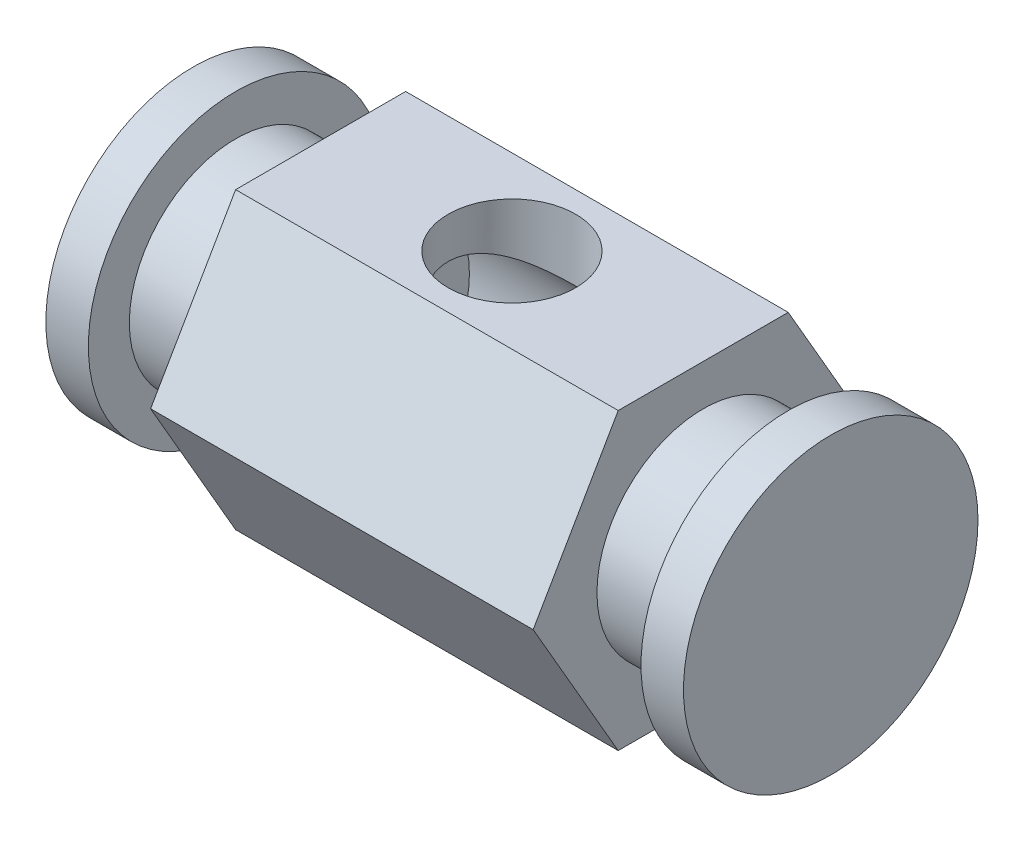
ISO-10303-21;
HEADER;
FILE_DESCRIPTION(('STEP AP214'),'2;1');
FILE_NAME('part.step','',(''),(''),'','','');
FILE_SCHEMA(('AUTOMOTIVE_DESIGN { 1 0 10303 214 1 1 1 1 }'));
ENDSEC;
DATA;
#1=APPLICATION_CONTEXT('core data for automotive mechanical design processes');
#2=APPLICATION_PROTOCOL_DEFINITION('international standard','automotive_design',2000,#1);
#3=PRODUCT_CONTEXT('',#1,'mechanical');
#4=PRODUCT('Part','Part','',(#3));
#5=PRODUCT_RELATED_PRODUCT_CATEGORY('part','',(#4));
#6=PRODUCT_DEFINITION_FORMATION('','',#4);
#7=PRODUCT_DEFINITION_CONTEXT('part definition',#1,'design');
#8=PRODUCT_DEFINITION('design','',#6,#7);
#9=PRODUCT_DEFINITION_SHAPE('','',#8);
#10=(LENGTH_UNIT() NAMED_UNIT(*) SI_UNIT(.MILLI.,.METRE.));
#11=(NAMED_UNIT(*) PLANE_ANGLE_UNIT() SI_UNIT($,.RADIAN.));
#12=(NAMED_UNIT(*) SI_UNIT($,.STERADIAN.) SOLID_ANGLE_UNIT());
#13=UNCERTAINTY_MEASURE_WITH_UNIT(LENGTH_MEASURE(1.E-05),#10,'distance_accuracy_value','');
#14=(GEOMETRIC_REPRESENTATION_CONTEXT(3) GLOBAL_UNCERTAINTY_ASSIGNED_CONTEXT((#13)) GLOBAL_UNIT_ASSIGNED_CONTEXT((#10,
#11,#12)) REPRESENTATION_CONTEXT('',''));
#15=CARTESIAN_POINT('',(0.,0.,0.));
#16=DIRECTION('',(0.,0.,1.));
#17=DIRECTION('',(1.,0.,0.));
#18=AXIS2_PLACEMENT_3D('',#15,#16,#17);
#19=CARTESIAN_POINT('',(22.5,0.,0.));
#20=DIRECTION('',(-1.,0.,0.));
#21=DIRECTION('',(0.,0.,1.));
#22=AXIS2_PLACEMENT_3D('',#19,#20,#21);
#23=CYLINDRICAL_SURFACE('',#22,12.5);
#24=CARTESIAN_POINT('',(17.5,0.,0.));
#25=DIRECTION('',(1.,0.,0.));
#26=DIRECTION('',(0.,0.,-1.));
#27=AXIS2_PLACEMENT_3D('',#24,#25,#26);
#28=CIRCLE('',#27,12.5);
#29=CARTESIAN_POINT('',(17.5,0.,-12.5));
#30=VERTEX_POINT('',#29);
#31=EDGE_CURVE('E208',#30,#30,#28,.T.);
#32=ORIENTED_EDGE('',*,*,#31,.T.);
#33=EDGE_LOOP('',(#32));
#34=FACE_BOUND('',#33,.T.);
#35=CARTESIAN_POINT('',(0.,-10.,7.5));
#36=CARTESIAN_POINT('',(0.188692773104688,-9.99999823078383,7.50000120679242));
#37=CARTESIAN_POINT('',(0.377372231482413,-10.0053601477454,7.49286874148265));
#38=CARTESIAN_POINT('',(0.753055741609481,-10.0265610634639,7.46447502665632));
#39=CARTESIAN_POINT('',(0.940059904060489,-10.0423993646996,7.44321471777582));
#40=CARTESIAN_POINT('',(1.31103429157001,-10.0838875511475,7.38690918482064));
#41=CARTESIAN_POINT('',(1.49500158372569,-10.1095464015261,7.35185136418562));
#42=CARTESIAN_POINT('',(1.85843271331336,-10.1696429705428,7.26849331083707));
#43=CARTESIAN_POINT('',(2.0378963147779,-10.2040811481166,7.22019238583577));
#44=CARTESIAN_POINT('',(2.38994614713429,-10.2802003218269,7.11138858218429));
#45=CARTESIAN_POINT('',(2.56257402518394,-10.3218247593381,7.05098043543781));
#46=CARTESIAN_POINT('',(2.90163367268208,-10.4111819148763,6.9183586416477));
#47=CARTESIAN_POINT('',(3.06806298347129,-10.4589170240795,6.84614037008011));
#48=CARTESIAN_POINT('',(3.5570088898786,-10.6092473794473,6.61272201077553));
#49=CARTESIAN_POINT('',(3.86941771930208,-10.7190214536722,6.43468492430838));
#50=CARTESIAN_POINT('',(4.49983310186811,-10.961457844936,6.01351023928956));
#51=CARTESIAN_POINT('',(4.81385372032728,-11.0952775973879,5.76507448644969));
#52=CARTESIAN_POINT('',(5.25250928504391,-11.2947767726125,5.35733763463461));
#53=CARTESIAN_POINT('',(5.39341905252056,-11.3611173580496,5.21546669500758));
#54=CARTESIAN_POINT('',(5.66389561288898,-11.4919832543935,4.92039993723567));
#55=CARTESIAN_POINT('',(5.79346040775826,-11.5565082441938,4.76720213298469));
#56=CARTESIAN_POINT('',(6.05387736830032,-11.6891210188159,4.43285564137838));
#57=CARTESIAN_POINT('',(6.18334510449195,-11.7568362139061,4.25047753744622));
#58=CARTESIAN_POINT('',(6.42623807951091,-11.8863782053003,3.87346312854206));
#59=CARTESIAN_POINT('',(6.53967045659397,-11.9482076176741,3.67883233406749));
#60=CARTESIAN_POINT('',(6.74929824514343,-12.0642201883362,3.2784164671804));
#61=CARTESIAN_POINT('',(6.84550107726848,-12.1184066362557,3.07263624673865));
#62=CARTESIAN_POINT('',(7.01944969456585,-12.2175104392727,2.65127326533902));
#63=CARTESIAN_POINT('',(7.0971985128734,-12.2624293174459,2.43569212222876));
#64=CARTESIAN_POINT('',(7.2265508104083,-12.3377691728578,2.01747359212342));
#65=CARTESIAN_POINT('',(7.27994111935902,-12.3691645244113,1.81556383007454));
#66=CARTESIAN_POINT('',(7.36985691367482,-12.4222973608661,1.40676725051505));
#67=CARTESIAN_POINT('',(7.40638337680498,-12.4440354056949,1.19988072228908));
#68=CARTESIAN_POINT('',(7.46196289662482,-12.477194920202,0.783116791483749));
#69=CARTESIAN_POINT('',(7.48102963470044,-12.4886244674807,0.573241861806046));
#70=CARTESIAN_POINT('',(7.50141157120872,-12.5008442041257,0.152330680482684));
#71=CARTESIAN_POINT('',(7.50272857571368,-12.5016354759586,-0.0587054508221876));
#72=CARTESIAN_POINT('',(7.48853906892484,-12.4931260267531,-0.453714777156578));
#73=CARTESIAN_POINT('',(7.47510185603572,-12.4850666053635,-0.637793616435806));
#74=CARTESIAN_POINT('',(7.43478376412771,-12.4609689355091,-1.00394655598314));
#75=CARTESIAN_POINT('',(7.40790295021372,-12.4449307256842,-1.18602066595543));
#76=CARTESIAN_POINT('',(7.3410358323648,-12.4052442277447,-1.54689074708866));
#77=CARTESIAN_POINT('',(7.30104970200605,-12.3815960404222,-1.72568676163393));
#78=CARTESIAN_POINT('',(7.20844210361948,-12.3272151907499,-2.07886939421951));
#79=CARTESIAN_POINT('',(7.155820114962,-12.2964822364917,-2.25325583024659));
#80=CARTESIAN_POINT('',(7.03817333792658,-12.2283918721564,-2.59757407732022));
#81=CARTESIAN_POINT('',(6.97308161624169,-12.1909987925766,-2.76747594566571));
#82=CARTESIAN_POINT('',(6.83130799278641,-12.1104656177526,-3.10098446114959));
#83=CARTESIAN_POINT('',(6.7546222287775,-12.0673236079794,-3.26458898762978));
#84=CARTESIAN_POINT('',(6.50814521196327,-11.9305144973489,-3.74477506801769));
#85=CARTESIAN_POINT('',(6.3218550439595,-11.8294173233651,-4.05095816681986));
#86=CARTESIAN_POINT('',(5.88579358864849,-11.6018914143767,-4.66541618539828));
#87=CARTESIAN_POINT('',(5.63109761876534,-11.4738793152295,-4.9695726070298));
#88=CARTESIAN_POINT('',(5.07794018109779,-11.2127575101819,-5.5335940307367));
#89=CARTESIAN_POINT('',(4.77941947736904,-11.0796410878055,-5.7933980391173));
#90=CARTESIAN_POINT('',(4.28409925606161,-10.8778361830914,-6.15997312633097));
#91=CARTESIAN_POINT('',(4.10058958896489,-10.8066538673819,-6.28366126969308));
#92=CARTESIAN_POINT('',(3.72202575670407,-10.6687579062864,-6.51503745890077));
#93=CARTESIAN_POINT('',(3.52696970058253,-10.602044996692,-6.62272287377845));
#94=CARTESIAN_POINT('',(3.12652125290092,-10.4756432504103,-6.82090231570387));
#95=CARTESIAN_POINT('',(2.92114494481455,-10.4159439402154,-6.91142210385062));
#96=CARTESIAN_POINT('',(2.50090829012674,-10.305992775228,-7.07433274728352));
#97=CARTESIAN_POINT('',(2.28605170832038,-10.2557372111069,-7.14673072420734));
#98=CARTESIAN_POINT('',(1.90263340778911,-10.178114111283,-7.25667461828035));
#99=CARTESIAN_POINT('',(1.73578617557886,-10.1481606268142,-7.29841140631324));
#100=CARTESIAN_POINT('',(1.39847645342368,-10.0959398034874,-7.37048077339704));
#101=CARTESIAN_POINT('',(1.22801477044022,-10.0736707677861,-7.40081587024739));
#102=CARTESIAN_POINT('',(0.88467910293567,-10.037606550335,-7.44965633189382));
#103=CARTESIAN_POINT('',(0.711807598531673,-10.0238032320233,-7.4681730562511));
#104=CARTESIAN_POINT('',(0.364704061930949,-10.0051477481708,-7.49314782944574));
#105=CARTESIAN_POINT('',(0.190472000959253,-10.0002957724635,-7.4996056225464));
#106=CARTESIAN_POINT('',(-0.158273249010935,-9.99973014508067,-7.50035982068346));
#107=CARTESIAN_POINT('',(-0.332786495033985,-10.0040290732705,-7.49463948428721));
#108=CARTESIAN_POINT('',(-0.680531944099266,-10.0216248303757,-7.47109423447713));
#109=CARTESIAN_POINT('',(-0.853764140464238,-10.034921706158,-7.45326925801477));
#110=CARTESIAN_POINT('',(-1.1977974129686,-10.0700255654224,-7.40577159941338));
#111=CARTESIAN_POINT('',(-1.36859727685108,-10.0918366483772,-7.37609320986082));
#112=CARTESIAN_POINT('',(-1.70667432339135,-10.1432145107887,-7.30527949826134));
#113=CARTESIAN_POINT('',(-1.8739500378864,-10.172784456172,-7.26413949899432));
#114=CARTESIAN_POINT('',(-2.20374031188016,-10.2386720947097,-7.17097191379845));
#115=CARTESIAN_POINT('',(-2.36626272005138,-10.274977841261,-7.1189635835979));
#116=CARTESIAN_POINT('',(-2.68619223147815,-10.3533352508685,-7.00451682931186));
#117=CARTESIAN_POINT('',(-2.8435976378413,-10.3953887964191,-6.94207498659024));
#118=CARTESIAN_POINT('',(-3.30723467778529,-10.5285418463914,-6.73987072741965));
#119=CARTESIAN_POINT('',(-3.60504547886708,-10.6266672038671,-6.58518422132203));
#120=CARTESIAN_POINT('',(-4.22628250436646,-10.8518645415799,-6.20832715462771));
#121=CARTESIAN_POINT('',(-4.54464774892117,-10.9809658731543,-5.9790180424004));
#122=CARTESIAN_POINT('',(-4.99214330661705,-11.1760249043361,-5.60060254239724));
#123=CARTESIAN_POINT('',(-5.13640074272676,-11.2413306806479,-5.46860539765543));
#124=CARTESIAN_POINT('',(-5.41443062347967,-11.3710562458251,-5.19347495646691));
#125=CARTESIAN_POINT('',(-5.54820120771097,-11.4354758758204,-5.05033969300513));
#126=CARTESIAN_POINT('',(-5.82131514437674,-11.5702992750371,-4.73407411681794));
#127=CARTESIAN_POINT('',(-5.95910849863414,-11.6403872249459,-4.55946685321339));
#128=CARTESIAN_POINT('',(-6.21936179384066,-11.7757426572854,-4.19752243251675));
#129=CARTESIAN_POINT('',(-6.34182793854949,-11.8410120856195,-4.01019047347924));
#130=CARTESIAN_POINT('',(-6.57031577035696,-11.9649421100263,-3.62371710093581));
#131=CARTESIAN_POINT('',(-6.67634116026973,-12.0236041933995,-3.4245783605802));
#132=CARTESIAN_POINT('',(-6.87072708731596,-12.1326177402039,-3.0156810985293));
#133=CARTESIAN_POINT('',(-6.95909003276554,-12.1829703364898,-2.80592402956304));
#134=CARTESIAN_POINT('',(-7.1111773112232,-12.2705038668088,-2.39290771317297));
#135=CARTESIAN_POINT('',(-7.17622475903736,-12.308375712443,-2.19028248858964));
#136=CARTESIAN_POINT('',(-7.28913769564021,-12.3745477559289,-1.778758838461));
#137=CARTESIAN_POINT('',(-7.3370038235628,-12.4028483098242,-1.56986064657932));
#138=CARTESIAN_POINT('',(-7.41475182068993,-12.4489985951498,-1.14780479520938));
#139=CARTESIAN_POINT('',(-7.44465062820149,-12.4668581691577,-0.934651343809274));
#140=CARTESIAN_POINT('',(-7.48601236995236,-12.4916012697912,-0.505939659922356));
#141=CARTESIAN_POINT('',(-7.49747770748443,-12.4984862272487,-0.290381744611884));
#142=CARTESIAN_POINT('',(-7.50149083731495,-12.5008948532131,0.112151821569249));
#143=CARTESIAN_POINT('',(-7.49635999809251,-12.4978126770678,0.299101086082838));
#144=CARTESIAN_POINT('',(-7.47218709467063,-12.4833282510086,0.671773742150895));
#145=CARTESIAN_POINT('',(-7.45314537944419,-12.4719262098097,0.857497164339332));
#146=CARTESIAN_POINT('',(-7.40140400507448,-12.4410751634198,1.22633646290172));
#147=CARTESIAN_POINT('',(-7.36870500971334,-12.4216265493153,1.40945246555634));
#148=CARTESIAN_POINT('',(-7.29006169982175,-12.3751361717483,1.77183006760248));
#149=CARTESIAN_POINT('',(-7.24411698832095,-12.3480941807152,1.9510915513021));
#150=CARTESIAN_POINT('',(-7.14036425079735,-12.2875162258367,2.30175557439519));
#151=CARTESIAN_POINT('',(-7.08276181686451,-12.2540933057182,2.47323858855957));
#152=CARTESIAN_POINT('',(-6.95583265831419,-12.1811708599912,2.81049732306679));
#153=CARTESIAN_POINT('',(-6.88650213772686,-12.1416693673375,2.97627117457875));
#154=CARTESIAN_POINT('',(-6.66186004706047,-12.0151967745144,3.46373719515787));
#155=CARTESIAN_POINT('',(-6.48982400648675,-11.9202132953099,3.7758204727761));
#156=CARTESIAN_POINT('',(-6.08534983857752,-11.7046609545403,4.401374151397));
#157=CARTESIAN_POINT('',(-5.84838193641815,-11.5824339466914,4.7113171053629));
#158=CARTESIAN_POINT('',(-5.33125937723798,-11.3301036620341,5.28946389728756));
#159=CARTESIAN_POINT('',(-5.05105687747664,-11.1999917579732,5.55762082660486));
#160=CARTESIAN_POINT('',(-4.41348879871702,-10.9263829364944,6.07959239913489));
#161=CARTESIAN_POINT('',(-4.05084402361769,-10.7832810292532,6.32727585963683));
#162=CARTESIAN_POINT('',(-3.47462714205365,-10.5849217173034,6.65022773867512));
#163=CARTESIAN_POINT('',(-3.27711979225767,-10.5215019916803,6.74980398536693));
#164=CARTESIAN_POINT('',(-2.87201477324607,-10.4024521257067,6.93186784584636));
#165=CARTESIAN_POINT('',(-2.66441725456022,-10.3468218691974,7.01435571446969));
#166=CARTESIAN_POINT('',(-2.25848300148507,-10.2501351559249,7.15481558011699));
#167=CARTESIAN_POINT('',(-2.06086076902219,-10.2082415060397,7.21427616671245));
#168=CARTESIAN_POINT('',(-1.65965877490963,-10.1348719640507,7.31699130623615));
#169=CARTESIAN_POINT('',(-1.45608299276073,-10.103389278735,7.36025642923621));
#170=CARTESIAN_POINT('',(-1.04488685636496,-10.0523754060515,7.42977906555983));
#171=CARTESIAN_POINT('',(-0.837273411131533,-10.0328253876625,7.45606338026241));
#172=CARTESIAN_POINT('',(-0.419767626510736,-10.0066394811847,7.49117207766574));
#173=CARTESIAN_POINT('',(-0.209875577270451,-10.0000019678298,7.49999865773208));
#174=CARTESIAN_POINT('',(0.,-10.,7.5));
#175=B_SPLINE_CURVE_WITH_KNOTS('',3,(#35,#36,#37,#38,#39,#40,#41,#42,#43,#44,#45,#46,#47,#48,
#49,#50,#51,#52,#53,#54,#55,#56,#57,#58,#59,#60,#61,#62,#63,#64,#65,#66,#67,#68,#69,#70,#71,#72,
#73,#74,#75,#76,#77,#78,#79,#80,#81,#82,#83,#84,#85,#86,#87,#88,#89,#90,#91,#92,#93,#94,#95,#96,
#97,#98,#99,#100,#101,#102,#103,#104,#105,#106,#107,#108,#109,#110,#111,#112,#113,#114,#115,
#116,#117,#118,#119,#120,#121,#122,#123,#124,#125,#126,#127,#128,#129,#130,#131,#132,#133,#134,
#135,#136,#137,#138,#139,#140,#141,#142,#143,#144,#145,#146,#147,#148,#149,#150,#151,#152,#153,
#154,#155,#156,#157,#158,#159,#160,#161,#162,#163,#164,#165,#166,#167,#168,#169,#170,#171,#172,
#173,#174),.UNSPECIFIED.,.T.,.F.,(4,2,2,2,2,2,2,2,2,2,2,2,2,2,2,2,2,2,2,2,2,2,2,2,2,2,2,2,2,2,2,
2,2,2,2,2,2,2,2,2,2,2,2,2,2,2,2,2,2,2,2,2,2,2,2,2,2,2,2,2,2,2,2,2,2,2,2,2,2,4),(0.,
0.565847664941352,1.13165765934977,1.69798541775812,2.26434278678839,2.82643055762257,
3.38873895609719,4.51260964228029,5.77389395070291,6.40541950298795,7.03705605377578,
7.73719785519436,8.43702699531025,9.13655399467041,9.83596593876093,10.4686435438572,
11.101284461724,11.7334292188741,12.3655096534955,12.9190805875071,13.4726488407014,
14.026209762338,14.5797934960143,15.1364364428117,15.6932652302445,16.8061898968696,
18.052047981167,19.2996058111948,19.9962788030126,20.6930662066484,21.3887994932595,
22.0842589348901,22.6074630613155,23.1305515822502,23.6531365617513,24.1757326237138,
24.6990475691323,25.222365240323,25.7459351931216,26.2697191165561,26.7925827878468,
27.3156181173834,28.3611893568746,29.5952538232474,30.2132528522665,30.8313612699863,
31.5301138305572,32.2285826467617,32.9268939234563,33.625109918705,34.2726300267248,
34.920126044922,35.5670106885767,36.2138109867834,36.774254703411,37.3346843610389,
37.895086783382,38.4555060025722,39.006789842679,39.5582524566087,40.6604022169002,
41.8822021246453,43.1053638842687,44.4836387355011,45.1731642163991,45.8626794137954,
46.4935387877718,47.1239857065273,47.7534351229369,48.3828053069281),.UNSPECIFIED.);
#176=CARTESIAN_POINT('',(0.,-10.,7.5));
#177=VERTEX_POINT('',#176);
#178=EDGE_CURVE('E36',#177,#177,#175,.T.);
#179=ORIENTED_EDGE('',*,*,#178,.F.);
#180=EDGE_LOOP('',(#179));
#181=FACE_BOUND('',#180,.T.);
#182=CARTESIAN_POINT('',(0.,10.,7.5));
#183=CARTESIAN_POINT('',(-0.188692773104688,9.99999823078383,7.50000120679242));
#184=CARTESIAN_POINT('',(-0.377372231482413,10.0053601477454,7.49286874148265));
#185=CARTESIAN_POINT('',(-0.753055741609481,10.0265610634639,7.46447502665632));
#186=CARTESIAN_POINT('',(-0.940059904060488,10.0423993646996,7.44321471777582));
#187=CARTESIAN_POINT('',(-1.31103429157001,10.0838875511475,7.38690918482064));
#188=CARTESIAN_POINT('',(-1.49500158372569,10.1095464015261,7.35185136418562));
#189=CARTESIAN_POINT('',(-1.85843271331336,10.1696429705428,7.26849331083707));
#190=CARTESIAN_POINT('',(-2.0378963147779,10.2040811481166,7.22019238583578));
#191=CARTESIAN_POINT('',(-2.38994614713428,10.2802003218269,7.1113885821843));
#192=CARTESIAN_POINT('',(-2.56257402518393,10.3218247593381,7.05098043543782));
#193=CARTESIAN_POINT('',(-2.90163367268208,10.4111819148763,6.9183586416477));
#194=CARTESIAN_POINT('',(-3.06806298347128,10.4589170240795,6.84614037008012));
#195=CARTESIAN_POINT('',(-3.5570088898786,10.6092473794473,6.61272201077553));
#196=CARTESIAN_POINT('',(-3.86941771930208,10.7190214536722,6.43468492430838));
#197=CARTESIAN_POINT('',(-4.4998331018681,10.961457844936,6.01351023928957));
#198=CARTESIAN_POINT('',(-4.81385372032728,11.0952775973879,5.7650744864497));
#199=CARTESIAN_POINT('',(-5.25250928504391,11.2947767726125,5.35733763463462));
#200=CARTESIAN_POINT('',(-5.39341905252056,11.3611173580496,5.21546669500759));
#201=CARTESIAN_POINT('',(-5.66389561288898,11.4919832543935,4.92039993723567));
#202=CARTESIAN_POINT('',(-5.79346040775825,11.5565082441938,4.7672021329847));
#203=CARTESIAN_POINT('',(-6.05387736830032,11.6891210188159,4.43285564137839));
#204=CARTESIAN_POINT('',(-6.18334510449195,11.7568362139061,4.25047753744623));
#205=CARTESIAN_POINT('',(-6.4262380795109,11.8863782053003,3.87346312854207));
#206=CARTESIAN_POINT('',(-6.53967045659396,11.9482076176741,3.6788323340675));
#207=CARTESIAN_POINT('',(-6.74929824514343,12.0642201883362,3.27841646718041));
#208=CARTESIAN_POINT('',(-6.84550107726848,12.1184066362557,3.07263624673866));
#209=CARTESIAN_POINT('',(-7.01944969456585,12.2175104392727,2.65127326533903));
#210=CARTESIAN_POINT('',(-7.0971985128734,12.2624293174459,2.43569212222877));
#211=CARTESIAN_POINT('',(-7.2265508104083,12.3377691728578,2.01747359212343));
#212=CARTESIAN_POINT('',(-7.27994111935902,12.3691645244113,1.81556383007455));
#213=CARTESIAN_POINT('',(-7.36985691367482,12.4222973608661,1.40676725051506));
#214=CARTESIAN_POINT('',(-7.40638337680498,12.4440354056949,1.19988072228909));
#215=CARTESIAN_POINT('',(-7.46196289662482,12.477194920202,0.783116791483759));
#216=CARTESIAN_POINT('',(-7.48102963470043,12.4886244674807,0.573241861806056));
#217=CARTESIAN_POINT('',(-7.50141157120872,12.5008442041257,0.152330680482695));
#218=CARTESIAN_POINT('',(-7.50272857571368,12.5016354759586,-0.0587054508221778));
#219=CARTESIAN_POINT('',(-7.48853906892484,12.4931260267531,-0.453714777156568));
#220=CARTESIAN_POINT('',(-7.47510185603573,12.4850666053635,-0.637793616435796));
#221=CARTESIAN_POINT('',(-7.43478376412771,12.4609689355091,-1.00394655598314));
#222=CARTESIAN_POINT('',(-7.40790295021372,12.4449307256842,-1.18602066595542));
#223=CARTESIAN_POINT('',(-7.3410358323648,12.4052442277447,-1.54689074708866));
#224=CARTESIAN_POINT('',(-7.30104970200605,12.3815960404222,-1.72568676163393));
#225=CARTESIAN_POINT('',(-7.20844210361948,12.3272151907499,-2.0788693942195));
#226=CARTESIAN_POINT('',(-7.155820114962,12.2964822364917,-2.25325583024658));
#227=CARTESIAN_POINT('',(-7.03817333792658,12.2283918721564,-2.59757407732021));
#228=CARTESIAN_POINT('',(-6.97308161624169,12.1909987925766,-2.76747594566571));
#229=CARTESIAN_POINT('',(-6.83130799278642,12.1104656177526,-3.10098446114958));
#230=CARTESIAN_POINT('',(-6.7546222287775,12.0673236079794,-3.26458898762977));
#231=CARTESIAN_POINT('',(-6.50814521196328,11.9305144973489,-3.74477506801769));
#232=CARTESIAN_POINT('',(-6.3218550439595,11.8294173233651,-4.05095816681985));
#233=CARTESIAN_POINT('',(-5.8857935886485,11.6018914143767,-4.66541618539827));
#234=CARTESIAN_POINT('',(-5.63109761876534,11.4738793152295,-4.96957260702979));
#235=CARTESIAN_POINT('',(-5.0779401810978,11.2127575101819,-5.5335940307367));
#236=CARTESIAN_POINT('',(-4.77941947736905,11.0796410878055,-5.79339803911729));
#237=CARTESIAN_POINT('',(-4.28409925606161,10.8778361830914,-6.15997312633096));
#238=CARTESIAN_POINT('',(-4.1005895889649,10.8066538673819,-6.28366126969308));
#239=CARTESIAN_POINT('',(-3.72202575670408,10.6687579062864,-6.51503745890076));
#240=CARTESIAN_POINT('',(-3.52696970058254,10.602044996692,-6.62272287377845));
#241=CARTESIAN_POINT('',(-3.12652125290092,10.4756432504103,-6.82090231570386));
#242=CARTESIAN_POINT('',(-2.92114494481456,10.4159439402154,-6.91142210385062));
#243=CARTESIAN_POINT('',(-2.50090829012675,10.305992775228,-7.07433274728351));
#244=CARTESIAN_POINT('',(-2.28605170832039,10.2557372111069,-7.14673072420734));
#245=CARTESIAN_POINT('',(-1.90263340778912,10.178114111283,-7.25667461828035));
#246=CARTESIAN_POINT('',(-1.73578617557887,10.1481606268142,-7.29841140631324));
#247=CARTESIAN_POINT('',(-1.3984764534237,10.0959398034874,-7.37048077339703));
#248=CARTESIAN_POINT('',(-1.22801477044023,10.0736707677861,-7.40081587024738));
#249=CARTESIAN_POINT('',(-0.88467910293568,10.0376065503351,-7.44965633189382));
#250=CARTESIAN_POINT('',(-0.711807598531683,10.0238032320233,-7.4681730562511));
#251=CARTESIAN_POINT('',(-0.36470406193096,10.0051477481708,-7.49314782944574));
#252=CARTESIAN_POINT('',(-0.190472000959263,10.0002957724635,-7.4996056225464));
#253=CARTESIAN_POINT('',(0.158273249010925,9.99973014508067,-7.50035982068346));
#254=CARTESIAN_POINT('',(0.332786495033975,10.0040290732705,-7.49463948428721));
#255=CARTESIAN_POINT('',(0.680531944099254,10.0216248303757,-7.47109423447713));
#256=CARTESIAN_POINT('',(0.853764140464226,10.034921706158,-7.45326925801477));
#257=CARTESIAN_POINT('',(1.19779741296858,10.0700255654224,-7.40577159941338));
#258=CARTESIAN_POINT('',(1.36859727685107,10.0918366483772,-7.37609320986082));
#259=CARTESIAN_POINT('',(1.70667432339134,10.1432145107887,-7.30527949826135));
#260=CARTESIAN_POINT('',(1.87395003788639,10.172784456172,-7.26413949899432));
#261=CARTESIAN_POINT('',(2.20374031188015,10.2386720947097,-7.17097191379845));
#262=CARTESIAN_POINT('',(2.36626272005137,10.274977841261,-7.1189635835979));
#263=CARTESIAN_POINT('',(2.68619223147814,10.3533352508685,-7.00451682931186));
#264=CARTESIAN_POINT('',(2.84359763784129,10.3953887964191,-6.94207498659025));
#265=CARTESIAN_POINT('',(3.30723467778528,10.5285418463914,-6.73987072741965));
#266=CARTESIAN_POINT('',(3.60504547886707,10.6266672038671,-6.58518422132204));
#267=CARTESIAN_POINT('',(4.22628250436645,10.8518645415799,-6.20832715462772));
#268=CARTESIAN_POINT('',(4.54464774892116,10.9809658731543,-5.9790180424004));
#269=CARTESIAN_POINT('',(4.99214330661704,11.1760249043361,-5.60060254239724));
#270=CARTESIAN_POINT('',(5.13640074272675,11.2413306806479,-5.46860539765543));
#271=CARTESIAN_POINT('',(5.41443062347967,11.3710562458251,-5.19347495646691));
#272=CARTESIAN_POINT('',(5.54820120771097,11.4354758758204,-5.05033969300514));
#273=CARTESIAN_POINT('',(5.82131514437674,11.5702992750371,-4.73407411681794));
#274=CARTESIAN_POINT('',(5.95910849863413,11.6403872249459,-4.5594668532134));
#275=CARTESIAN_POINT('',(6.21936179384066,11.7757426572854,-4.19752243251676));
#276=CARTESIAN_POINT('',(6.34182793854949,11.8410120856195,-4.01019047347925));
#277=CARTESIAN_POINT('',(6.57031577035696,11.9649421100263,-3.62371710093582));
#278=CARTESIAN_POINT('',(6.67634116026972,12.0236041933995,-3.4245783605802));
#279=CARTESIAN_POINT('',(6.87072708731595,12.1326177402039,-3.0156810985293));
#280=CARTESIAN_POINT('',(6.95909003276554,12.1829703364898,-2.80592402956305));
#281=CARTESIAN_POINT('',(7.1111773112232,12.2705038668088,-2.39290771317298));
#282=CARTESIAN_POINT('',(7.17622475903735,12.308375712443,-2.19028248858965));
#283=CARTESIAN_POINT('',(7.2891376956402,12.3745477559289,-1.77875883846101));
#284=CARTESIAN_POINT('',(7.3370038235628,12.4028483098242,-1.56986064657933));
#285=CARTESIAN_POINT('',(7.41475182068993,12.4489985951498,-1.14780479520938));
#286=CARTESIAN_POINT('',(7.44465062820149,12.4668581691577,-0.934651343809283));
#287=CARTESIAN_POINT('',(7.48601236995236,12.4916012697912,-0.505939659922366));
#288=CARTESIAN_POINT('',(7.49747770748443,12.4984862272487,-0.290381744611894));
#289=CARTESIAN_POINT('',(7.50149083731495,12.5008948532131,0.112151821569239));
#290=CARTESIAN_POINT('',(7.4963599980925,12.4978126770678,0.299101086082827));
#291=CARTESIAN_POINT('',(7.47218709467063,12.4833282510086,0.671773742150885));
#292=CARTESIAN_POINT('',(7.45314537944419,12.4719262098097,0.857497164339321));
#293=CARTESIAN_POINT('',(7.40140400507448,12.4410751634198,1.22633646290171));
#294=CARTESIAN_POINT('',(7.36870500971334,12.4216265493153,1.40945246555633));
#295=CARTESIAN_POINT('',(7.29006169982175,12.3751361717483,1.77183006760247));
#296=CARTESIAN_POINT('',(7.24411698832095,12.3480941807152,1.95109155130209));
#297=CARTESIAN_POINT('',(7.14036425079735,12.2875162258367,2.30175557439518));
#298=CARTESIAN_POINT('',(7.08276181686451,12.2540933057182,2.47323858855956));
#299=CARTESIAN_POINT('',(6.95583265831419,12.1811708599912,2.81049732306679));
#300=CARTESIAN_POINT('',(6.88650213772687,12.1416693673375,2.97627117457874));
#301=CARTESIAN_POINT('',(6.66186004706047,12.0151967745144,3.46373719515786));
#302=CARTESIAN_POINT('',(6.48982400648675,11.9202132953099,3.77582047277609));
#303=CARTESIAN_POINT('',(6.08534983857753,11.7046609545403,4.40137415139699));
#304=CARTESIAN_POINT('',(5.84838193641816,11.5824339466914,4.71131710536289));
#305=CARTESIAN_POINT('',(5.33125937723799,11.3301036620341,5.28946389728755));
#306=CARTESIAN_POINT('',(5.05105687747665,11.1999917579732,5.55762082660485));
#307=CARTESIAN_POINT('',(4.41348879871703,10.9263829364944,6.07959239913488));
#308=CARTESIAN_POINT('',(4.0508440236177,10.7832810292532,6.32727585963683));
#309=CARTESIAN_POINT('',(3.47462714205367,10.5849217173034,6.65022773867511));
#310=CARTESIAN_POINT('',(3.27711979225769,10.5215019916803,6.74980398536692));
#311=CARTESIAN_POINT('',(2.87201477324609,10.4024521257067,6.93186784584635));
#312=CARTESIAN_POINT('',(2.66441725456023,10.3468218691974,7.01435571446968));
#313=CARTESIAN_POINT('',(2.25848300148508,10.2501351559249,7.15481558011699));
#314=CARTESIAN_POINT('',(2.06086076902221,10.2082415060397,7.21427616671245));
#315=CARTESIAN_POINT('',(1.65965877490964,10.1348719640507,7.31699130623615));
#316=CARTESIAN_POINT('',(1.45608299276074,10.103389278735,7.3602564292362));
#317=CARTESIAN_POINT('',(1.04488685636497,10.0523754060515,7.42977906555983));
#318=CARTESIAN_POINT('',(0.837273411131539,10.0328253876624,7.45606338026241));
#319=CARTESIAN_POINT('',(0.419767626510737,10.0066394811847,7.49117207766574));
#320=CARTESIAN_POINT('',(0.209875577270451,10.0000019678298,7.49999865773208));
#321=CARTESIAN_POINT('',(0.,10.,7.5));
#322=B_SPLINE_CURVE_WITH_KNOTS('',3,(#182,#183,#184,#185,#186,#187,#188,#189,#190,#191,#192,
#193,#194,#195,#196,#197,#198,#199,#200,#201,#202,#203,#204,#205,#206,#207,#208,#209,#210,#211,
#212,#213,#214,#215,#216,#217,#218,#219,#220,#221,#222,#223,#224,#225,#226,#227,#228,#229,#230,
#231,#232,#233,#234,#235,#236,#237,#238,#239,#240,#241,#242,#243,#244,#245,#246,#247,#248,#249,
#250,#251,#252,#253,#254,#255,#256,#257,#258,#259,#260,#261,#262,#263,#264,#265,#266,#267,#268,
#269,#270,#271,#272,#273,#274,#275,#276,#277,#278,#279,#280,#281,#282,#283,#284,#285,#286,#287,
#288,#289,#290,#291,#292,#293,#294,#295,#296,#297,#298,#299,#300,#301,#302,#303,#304,#305,#306,
#307,#308,#309,#310,#311,#312,#313,#314,#315,#316,#317,#318,#319,#320,#321),.UNSPECIFIED.,.T.,
.F.,(4,2,2,2,2,2,2,2,2,2,2,2,2,2,2,2,2,2,2,2,2,2,2,2,2,2,2,2,2,2,2,2,2,2,2,2,2,2,2,2,2,2,2,2,2,
2,2,2,2,2,2,2,2,2,2,2,2,2,2,2,2,2,2,2,2,2,2,2,2,4),(0.,0.565847664941352,1.13165765934976,
1.69798541775812,2.26434278678838,2.82643055762257,3.38873895609718,4.51260964228029,
5.7738939507029,6.40541950298794,7.03705605377577,7.73719785519435,8.43702699531023,
9.13655399467039,9.83596593876092,10.4686435438572,11.101284461724,11.7334292188741,
12.3655096534955,12.9190805875071,13.4726488407014,14.026209762338,14.5797934960143,
15.1364364428117,15.6932652302445,16.8061898968696,18.052047981167,19.2996058111948,
19.9962788030126,20.6930662066484,21.3887994932595,22.0842589348901,22.6074630613155,
23.1305515822501,23.6531365617513,24.1757326237138,24.6990475691323,25.222365240323,
25.7459351931216,26.269719116556,26.7925827878467,27.3156181173834,28.3611893568746,
29.5952538232474,30.2132528522664,30.8313612699863,31.5301138305572,32.2285826467617,
32.9268939234562,33.6251099187049,34.2726300267248,34.920126044922,35.5670106885767,
36.2138109867834,36.774254703411,37.3346843610389,37.895086783382,38.4555060025722,
39.006789842679,39.5582524566087,40.6604022169001,41.8822021246453,43.1053638842686,
44.4836387355011,45.1731642163991,45.8626794137954,46.4935387877718,47.1239857065273,
47.7534351229369,48.3828053069281),.UNSPECIFIED.);
#323=CARTESIAN_POINT('',(0.,10.,7.5));
#324=VERTEX_POINT('',#323);
#325=EDGE_CURVE('E141',#324,#324,#322,.T.);
#326=ORIENTED_EDGE('',*,*,#325,.F.);
#327=EDGE_LOOP('',(#326));
#328=FACE_BOUND('',#327,.T.);
#329=CARTESIAN_POINT('',(-17.5,0.,0.));
#330=DIRECTION('',(1.,0.,0.));
#331=DIRECTION('',(0.,0.,-1.));
#332=AXIS2_PLACEMENT_3D('',#329,#330,#331);
#333=CIRCLE('',#332,12.5);
#334=CARTESIAN_POINT('',(-17.5,0.,-12.5));
#335=VERTEX_POINT('',#334);
#336=EDGE_CURVE('E216',#335,#335,#333,.T.);
#337=ORIENTED_EDGE('',*,*,#336,.F.);
#338=EDGE_LOOP('',(#337));
#339=FACE_BOUND('',#338,.T.);
#340=ADVANCED_FACE('F32',(#34,#181,#328,#339),#23,.F.);
#341=CARTESIAN_POINT('',(22.5,0.,0.));
#342=DIRECTION('',(1.,0.,0.));
#343=DIRECTION('',(0.,0.,-1.));
#344=AXIS2_PLACEMENT_3D('',#341,#342,#343);
#345=PLANE('',#344);
#346=DIRECTION('',(0.,0.866025403784438,0.5));
#347=VECTOR('',#346,1.);
#348=CARTESIAN_POINT('',(22.5,0.,-20.));
#349=LINE('',#348,#347);
#350=CARTESIAN_POINT('',(22.5,0.,-20.));
#351=VERTEX_POINT('',#350);
#352=CARTESIAN_POINT('',(22.5,17.3205080756888,-10.));
#353=VERTEX_POINT('',#352);
#354=EDGE_CURVE('E136',#351,#353,#349,.T.);
#355=ORIENTED_EDGE('',*,*,#354,.T.);
#356=DIRECTION('',(0.,0.,1.));
#357=VECTOR('',#356,1.);
#358=CARTESIAN_POINT('',(22.5,17.3205080756888,-10.));
#359=LINE('',#358,#357);
#360=CARTESIAN_POINT('',(22.5,17.3205080756888,10.));
#361=VERTEX_POINT('',#360);
#362=EDGE_CURVE('E93',#353,#361,#359,.T.);
#363=ORIENTED_EDGE('',*,*,#362,.T.);
#364=DIRECTION('',(0.,-0.866025403784439,0.5));
#365=VECTOR('',#364,1.);
#366=CARTESIAN_POINT('',(22.5,17.3205080756888,10.));
#367=LINE('',#366,#365);
#368=CARTESIAN_POINT('',(22.5,0.,20.));
#369=VERTEX_POINT('',#368);
#370=EDGE_CURVE('E107',#361,#369,#367,.T.);
#371=ORIENTED_EDGE('',*,*,#370,.T.);
#372=DIRECTION('',(0.,-0.866025403784438,-0.5));
#373=VECTOR('',#372,1.);
#374=CARTESIAN_POINT('',(22.5,0.,20.));
#375=LINE('',#374,#373);
#376=CARTESIAN_POINT('',(22.5,-17.3205080756888,9.99999999999999));
#377=VERTEX_POINT('',#376);
#378=EDGE_CURVE('E100',#369,#377,#375,.T.);
#379=ORIENTED_EDGE('',*,*,#378,.T.);
#380=DIRECTION('',(0.,0.,-1.));
#381=VECTOR('',#380,1.);
#382=CARTESIAN_POINT('',(22.5,-17.3205080756888,9.99999999999999));
#383=LINE('',#382,#381);
#384=CARTESIAN_POINT('',(22.5,-17.3205080756888,-10.));
#385=VERTEX_POINT('',#384);
#386=EDGE_CURVE('E105',#377,#385,#383,.T.);
#387=ORIENTED_EDGE('',*,*,#386,.T.);
#388=DIRECTION('',(0.,0.866025403784439,-0.5));
#389=VECTOR('',#388,1.);
#390=CARTESIAN_POINT('',(22.5,-17.3205080756888,-10.));
#391=LINE('',#390,#389);
#392=EDGE_CURVE('E56',#385,#351,#391,.T.);
#393=ORIENTED_EDGE('',*,*,#392,.T.);
#394=EDGE_LOOP('',(#355,#363,#371,#379,#387,#393));
#395=FACE_BOUND('',#394,.T.);
#396=CARTESIAN_POINT('',(22.5,0.,0.));
#397=DIRECTION('',(1.,0.,0.));
#398=DIRECTION('',(0.,0.,-1.));
#399=AXIS2_PLACEMENT_3D('',#396,#397,#398);
#400=CIRCLE('',#399,12.5);
#401=CARTESIAN_POINT('',(22.5,0.,-12.5));
#402=VERTEX_POINT('',#401);
#403=EDGE_CURVE('E129',#402,#402,#400,.T.);
#404=ORIENTED_EDGE('',*,*,#403,.F.);
#405=EDGE_LOOP('',(#404));
#406=FACE_BOUND('',#405,.T.);
#407=ADVANCED_FACE('F102',(#395,#406),#345,.T.);
#408=CARTESIAN_POINT('',(-22.5,0.,0.));
#409=DIRECTION('',(1.,0.,0.));
#410=DIRECTION('',(0.,0.,-1.));
#411=AXIS2_PLACEMENT_3D('',#408,#409,#410);
#412=PLANE('',#411);
#413=DIRECTION('',(0.,0.866025403784438,0.5));
#414=VECTOR('',#413,1.);
#415=CARTESIAN_POINT('',(-22.5,0.,-20.));
#416=LINE('',#415,#414);
#417=CARTESIAN_POINT('',(-22.5,0.,-20.));
#418=VERTEX_POINT('',#417);
#419=CARTESIAN_POINT('',(-22.5,17.3205080756888,-10.));
#420=VERTEX_POINT('',#419);
#421=EDGE_CURVE('E125',#418,#420,#416,.T.);
#422=ORIENTED_EDGE('',*,*,#421,.F.);
#423=DIRECTION('',(0.,0.866025403784439,-0.5));
#424=VECTOR('',#423,1.);
#425=CARTESIAN_POINT('',(-22.5,-17.3205080756888,-10.));
#426=LINE('',#425,#424);
#427=CARTESIAN_POINT('',(-22.5,-17.3205080756888,-10.));
#428=VERTEX_POINT('',#427);
#429=EDGE_CURVE('E85',#428,#418,#426,.T.);
#430=ORIENTED_EDGE('',*,*,#429,.F.);
#431=DIRECTION('',(0.,0.,-1.));
#432=VECTOR('',#431,1.);
#433=CARTESIAN_POINT('',(-22.5,-17.3205080756888,9.99999999999999));
#434=LINE('',#433,#432);
#435=CARTESIAN_POINT('',(-22.5,-17.3205080756888,9.99999999999999));
#436=VERTEX_POINT('',#435);
#437=EDGE_CURVE('E79',#436,#428,#434,.T.);
#438=ORIENTED_EDGE('',*,*,#437,.F.);
#439=DIRECTION('',(0.,-0.866025403784438,-0.5));
#440=VECTOR('',#439,1.);
#441=CARTESIAN_POINT('',(-22.5,0.,20.));
#442=LINE('',#441,#440);
#443=CARTESIAN_POINT('',(-22.5,0.,20.));
#444=VERTEX_POINT('',#443);
#445=EDGE_CURVE('E115',#444,#436,#442,.T.);
#446=ORIENTED_EDGE('',*,*,#445,.F.);
#447=DIRECTION('',(0.,-0.866025403784439,0.5));
#448=VECTOR('',#447,1.);
#449=CARTESIAN_POINT('',(-22.5,17.3205080756888,10.));
#450=LINE('',#449,#448);
#451=CARTESIAN_POINT('',(-22.5,17.3205080756888,10.));
#452=VERTEX_POINT('',#451);
#453=EDGE_CURVE('E131',#452,#444,#450,.T.);
#454=ORIENTED_EDGE('',*,*,#453,.F.);
#455=DIRECTION('',(0.,0.,1.));
#456=VECTOR('',#455,1.);
#457=CARTESIAN_POINT('',(-22.5,17.3205080756888,-10.));
#458=LINE('',#457,#456);
#459=EDGE_CURVE('E128',#420,#452,#458,.T.);
#460=ORIENTED_EDGE('',*,*,#459,.F.);
#461=EDGE_LOOP('',(#422,#430,#438,#446,#454,#460));
#462=FACE_BOUND('',#461,.T.);
#463=CARTESIAN_POINT('',(-22.5,0.,0.));
#464=DIRECTION('',(1.,0.,0.));
#465=DIRECTION('',(0.,0.,-1.));
#466=AXIS2_PLACEMENT_3D('',#463,#464,#465);
#467=CIRCLE('',#466,12.5);
#468=CARTESIAN_POINT('',(-22.5,0.,-12.5));
#469=VERTEX_POINT('',#468);
#470=EDGE_CURVE('E217',#469,#469,#467,.F.);
#471=ORIENTED_EDGE('',*,*,#470,.F.);
#472=EDGE_LOOP('',(#471));
#473=FACE_BOUND('',#472,.T.);
#474=ADVANCED_FACE('F204',(#462,#473),#412,.F.);
#475=CARTESIAN_POINT('',(22.5,0.,-20.));
#476=DIRECTION('',(0.,-0.5,0.866025403784438));
#477=DIRECTION('',(0.,-0.866025403784439,-0.5));
#478=AXIS2_PLACEMENT_3D('',#475,#476,#477);
#479=PLANE('',#478);
#480=ORIENTED_EDGE('',*,*,#421,.T.);
#481=DIRECTION('',(-1.,0.,0.));
#482=VECTOR('',#481,1.);
#483=CARTESIAN_POINT('',(22.5,17.3205080756888,-10.));
#484=LINE('',#483,#482);
#485=EDGE_CURVE('E11',#353,#420,#484,.T.);
#486=ORIENTED_EDGE('',*,*,#485,.F.);
#487=ORIENTED_EDGE('',*,*,#354,.F.);
#488=DIRECTION('',(-1.,0.,0.));
#489=VECTOR('',#488,1.);
#490=CARTESIAN_POINT('',(22.5,0.,-20.));
#491=LINE('',#490,#489);
#492=EDGE_CURVE('E121',#351,#418,#491,.T.);
#493=ORIENTED_EDGE('',*,*,#492,.T.);
#494=EDGE_LOOP('',(#480,#486,#487,#493));
#495=FACE_BOUND('',#494,.T.);
#496=ADVANCED_FACE('F34',(#495),#479,.F.);
#497=CARTESIAN_POINT('',(22.5,17.3205080756888,-10.));
#498=DIRECTION('',(0.,-1.,0.));
#499=DIRECTION('',(0.,0.,-1.));
#500=AXIS2_PLACEMENT_3D('',#497,#498,#499);
#501=PLANE('',#500);
#502=CARTESIAN_POINT('',(0.,17.3205080756888,0.));
#503=DIRECTION('',(0.,1.,0.));
#504=DIRECTION('',(0.,0.,1.));
#505=AXIS2_PLACEMENT_3D('',#502,#503,#504);
#506=CIRCLE('',#505,7.5);
#507=CARTESIAN_POINT('',(0.,17.3205080756888,7.5));
#508=VERTEX_POINT('',#507);
#509=EDGE_CURVE('E237',#508,#508,#506,.T.);
#510=ORIENTED_EDGE('',*,*,#509,.F.);
#511=EDGE_LOOP('',(#510));
#512=FACE_BOUND('',#511,.T.);
#513=ORIENTED_EDGE('',*,*,#459,.T.);
#514=DIRECTION('',(-1.,0.,0.));
#515=VECTOR('',#514,1.);
#516=CARTESIAN_POINT('',(22.5,17.3205080756888,10.));
#517=LINE('',#516,#515);
#518=EDGE_CURVE('E47',#361,#452,#517,.T.);
#519=ORIENTED_EDGE('',*,*,#518,.F.);
#520=ORIENTED_EDGE('',*,*,#362,.F.);
#521=ORIENTED_EDGE('',*,*,#485,.T.);
#522=EDGE_LOOP('',(#513,#519,#520,#521));
#523=FACE_BOUND('',#522,.T.);
#524=ADVANCED_FACE('F247',(#512,#523),#501,.F.);
#525=CARTESIAN_POINT('',(22.5,17.3205080756888,10.));
#526=DIRECTION('',(0.,-0.5,-0.866025403784439));
#527=DIRECTION('',(0.,0.866025403784439,-0.5));
#528=AXIS2_PLACEMENT_3D('',#525,#526,#527);
#529=PLANE('',#528);
#530=ORIENTED_EDGE('',*,*,#453,.T.);
#531=DIRECTION('',(-1.,0.,0.));
#532=VECTOR('',#531,1.);
#533=CARTESIAN_POINT('',(22.5,0.,20.));
#534=LINE('',#533,#532);
#535=EDGE_CURVE('E116',#369,#444,#534,.T.);
#536=ORIENTED_EDGE('',*,*,#535,.F.);
#537=ORIENTED_EDGE('',*,*,#370,.F.);
#538=ORIENTED_EDGE('',*,*,#518,.T.);
#539=EDGE_LOOP('',(#530,#536,#537,#538));
#540=FACE_BOUND('',#539,.T.);
#541=ADVANCED_FACE('F250',(#540),#529,.F.);
#542=CARTESIAN_POINT('',(22.5,0.,20.));
#543=DIRECTION('',(0.,0.5,-0.866025403784438));
#544=DIRECTION('',(0.,0.866025403784439,0.5));
#545=AXIS2_PLACEMENT_3D('',#542,#543,#544);
#546=PLANE('',#545);
#547=ORIENTED_EDGE('',*,*,#445,.T.);
#548=DIRECTION('',(-1.,0.,0.));
#549=VECTOR('',#548,1.);
#550=CARTESIAN_POINT('',(22.5,-17.3205080756888,9.99999999999999));
#551=LINE('',#550,#549);
#552=EDGE_CURVE('E112',#377,#436,#551,.T.);
#553=ORIENTED_EDGE('',*,*,#552,.F.);
#554=ORIENTED_EDGE('',*,*,#378,.F.);
#555=ORIENTED_EDGE('',*,*,#535,.T.);
#556=EDGE_LOOP('',(#547,#553,#554,#555));
#557=FACE_BOUND('',#556,.T.);
#558=ADVANCED_FACE('F113',(#557),#546,.F.);
#559=CARTESIAN_POINT('',(22.5,-17.3205080756888,9.99999999999999));
#560=DIRECTION('',(0.,1.,0.));
#561=DIRECTION('',(0.,0.,1.));
#562=AXIS2_PLACEMENT_3D('',#559,#560,#561);
#563=PLANE('',#562);
#564=CARTESIAN_POINT('',(0.,-17.3205080756888,0.));
#565=DIRECTION('',(0.,1.,0.));
#566=DIRECTION('',(0.,0.,1.));
#567=AXIS2_PLACEMENT_3D('',#564,#565,#566);
#568=CIRCLE('',#567,7.5);
#569=CARTESIAN_POINT('',(0.,-17.3205080756888,7.5));
#570=VERTEX_POINT('',#569);
#571=EDGE_CURVE('E146',#570,#570,#568,.T.);
#572=ORIENTED_EDGE('',*,*,#571,.T.);
#573=EDGE_LOOP('',(#572));
#574=FACE_BOUND('',#573,.T.);
#575=ORIENTED_EDGE('',*,*,#437,.T.);
#576=DIRECTION('',(-1.,0.,0.));
#577=VECTOR('',#576,1.);
#578=CARTESIAN_POINT('',(22.5,-17.3205080756888,-10.));
#579=LINE('',#578,#577);
#580=EDGE_CURVE('E117',#385,#428,#579,.T.);
#581=ORIENTED_EDGE('',*,*,#580,.F.);
#582=ORIENTED_EDGE('',*,*,#386,.F.);
#583=ORIENTED_EDGE('',*,*,#552,.T.);
#584=EDGE_LOOP('',(#575,#581,#582,#583));
#585=FACE_BOUND('',#584,.T.);
#586=ADVANCED_FACE('F119',(#574,#585),#563,.F.);
#587=CARTESIAN_POINT('',(22.5,-17.3205080756888,-10.));
#588=DIRECTION('',(0.,0.5,0.866025403784439));
#589=DIRECTION('',(0.,-0.866025403784439,0.5));
#590=AXIS2_PLACEMENT_3D('',#587,#588,#589);
#591=PLANE('',#590);
#592=ORIENTED_EDGE('',*,*,#429,.T.);
#593=ORIENTED_EDGE('',*,*,#492,.F.);
#594=ORIENTED_EDGE('',*,*,#392,.F.);
#595=ORIENTED_EDGE('',*,*,#580,.T.);
#596=EDGE_LOOP('',(#592,#593,#594,#595));
#597=FACE_BOUND('',#596,.T.);
#598=ADVANCED_FACE('F154',(#597),#591,.F.);
#599=CARTESIAN_POINT('',(0.,-17.3205080756888,0.));
#600=DIRECTION('',(0.,1.,0.));
#601=DIRECTION('',(0.,0.,1.));
#602=AXIS2_PLACEMENT_3D('',#599,#600,#601);
#603=CYLINDRICAL_SURFACE('',#602,7.5);
#604=ORIENTED_EDGE('',*,*,#325,.T.);
#605=EDGE_LOOP('',(#604));
#606=FACE_BOUND('',#605,.T.);
#607=ORIENTED_EDGE('',*,*,#509,.T.);
#608=EDGE_LOOP('',(#607));
#609=FACE_BOUND('',#608,.T.);
#610=ADVANCED_FACE('F149',(#606,#609),#603,.F.);
#611=ORIENTED_EDGE('',*,*,#178,.T.);
#612=EDGE_LOOP('',(#611));
#613=FACE_BOUND('',#612,.T.);
#614=ORIENTED_EDGE('',*,*,#571,.F.);
#615=EDGE_LOOP('',(#614));
#616=FACE_BOUND('',#615,.T.);
#617=ADVANCED_FACE('F153',(#613,#616),#603,.F.);
#618=CARTESIAN_POINT('',(17.5,0.,0.));
#619=DIRECTION('',(1.,0.,0.));
#620=DIRECTION('',(0.,0.,-1.));
#621=AXIS2_PLACEMENT_3D('',#618,#619,#620);
#622=PLANE('',#621);
#623=ORIENTED_EDGE('',*,*,#31,.F.);
#624=EDGE_LOOP('',(#623));
#625=FACE_BOUND('',#624,.T.);
#626=ADVANCED_FACE('F161',(#625),#622,.F.);
#627=CARTESIAN_POINT('',(17.5,0.,0.));
#628=DIRECTION('',(1.,0.,0.));
#629=DIRECTION('',(0.,0.,-1.));
#630=AXIS2_PLACEMENT_3D('',#627,#628,#629);
#631=CYLINDRICAL_SURFACE('',#630,12.5);
#632=ORIENTED_EDGE('',*,*,#403,.T.);
#633=EDGE_LOOP('',(#632));
#634=FACE_BOUND('',#633,.T.);
#635=CARTESIAN_POINT('',(32.5,0.,0.));
#636=DIRECTION('',(1.,0.,0.));
#637=DIRECTION('',(0.,0.,-1.));
#638=AXIS2_PLACEMENT_3D('',#635,#636,#637);
#639=CIRCLE('',#638,12.5);
#640=CARTESIAN_POINT('',(32.5,0.,-12.5));
#641=VERTEX_POINT('',#640);
#642=EDGE_CURVE('E231',#641,#641,#639,.T.);
#643=ORIENTED_EDGE('',*,*,#642,.F.);
#644=EDGE_LOOP('',(#643));
#645=FACE_BOUND('',#644,.T.);
#646=ADVANCED_FACE('F156',(#634,#645),#631,.T.);
#647=CARTESIAN_POINT('',(37.5,0.,0.));
#648=DIRECTION('',(-1.,0.,0.));
#649=DIRECTION('',(0.,0.,1.));
#650=AXIS2_PLACEMENT_3D('',#647,#648,#649);
#651=CYLINDRICAL_SURFACE('',#650,17.3205080756888);
#652=CARTESIAN_POINT('',(37.5,0.,0.));
#653=DIRECTION('',(1.,0.,0.));
#654=DIRECTION('',(0.,0.,-1.));
#655=AXIS2_PLACEMENT_3D('',#652,#653,#654);
#656=CIRCLE('',#655,17.3205080756888);
#657=CARTESIAN_POINT('',(37.5,0.,-17.3205080756888));
#658=VERTEX_POINT('',#657);
#659=EDGE_CURVE('E228',#658,#658,#656,.T.);
#660=ORIENTED_EDGE('',*,*,#659,.F.);
#661=EDGE_LOOP('',(#660));
#662=FACE_BOUND('',#661,.T.);
#663=CARTESIAN_POINT('',(32.5,0.,0.));
#664=DIRECTION('',(1.,0.,0.));
#665=DIRECTION('',(0.,0.,-1.));
#666=AXIS2_PLACEMENT_3D('',#663,#664,#665);
#667=CIRCLE('',#666,17.3205080756888);
#668=CARTESIAN_POINT('',(32.5,0.,-17.3205080756888));
#669=VERTEX_POINT('',#668);
#670=EDGE_CURVE('E221',#669,#669,#667,.T.);
#671=ORIENTED_EDGE('',*,*,#670,.T.);
#672=EDGE_LOOP('',(#671));
#673=FACE_BOUND('',#672,.T.);
#674=ADVANCED_FACE('F160',(#662,#673),#651,.T.);
#675=CARTESIAN_POINT('',(37.5,0.,0.));
#676=DIRECTION('',(1.,0.,0.));
#677=DIRECTION('',(0.,0.,-1.));
#678=AXIS2_PLACEMENT_3D('',#675,#676,#677);
#679=PLANE('',#678);
#680=ORIENTED_EDGE('',*,*,#659,.T.);
#681=EDGE_LOOP('',(#680));
#682=FACE_BOUND('',#681,.T.);
#683=ADVANCED_FACE('F168',(#682),#679,.T.);
#684=CARTESIAN_POINT('',(32.5,0.,0.));
#685=DIRECTION('',(1.,0.,0.));
#686=DIRECTION('',(0.,0.,-1.));
#687=AXIS2_PLACEMENT_3D('',#684,#685,#686);
#688=PLANE('',#687);
#689=ORIENTED_EDGE('',*,*,#642,.T.);
#690=EDGE_LOOP('',(#689));
#691=FACE_BOUND('',#690,.T.);
#692=ORIENTED_EDGE('',*,*,#670,.F.);
#693=EDGE_LOOP('',(#692));
#694=FACE_BOUND('',#693,.T.);
#695=ADVANCED_FACE('F170',(#691,#694),#688,.F.);
#696=CARTESIAN_POINT('',(-17.5,0.,0.));
#697=DIRECTION('',(-1.,0.,0.));
#698=DIRECTION('',(0.,0.,1.));
#699=AXIS2_PLACEMENT_3D('',#696,#697,#698);
#700=CYLINDRICAL_SURFACE('',#699,12.5);
#701=CARTESIAN_POINT('',(-32.5,0.,0.));
#702=DIRECTION('',(-1.,0.,0.));
#703=DIRECTION('',(0.,0.,1.));
#704=AXIS2_PLACEMENT_3D('',#701,#702,#703);
#705=CIRCLE('',#704,12.5);
#706=CARTESIAN_POINT('',(-32.5,0.,12.5));
#707=VERTEX_POINT('',#706);
#708=EDGE_CURVE('E218',#707,#707,#705,.T.);
#709=ORIENTED_EDGE('',*,*,#708,.F.);
#710=EDGE_LOOP('',(#709));
#711=FACE_BOUND('',#710,.T.);
#712=ORIENTED_EDGE('',*,*,#470,.T.);
#713=EDGE_LOOP('',(#712));
#714=FACE_BOUND('',#713,.T.);
#715=ADVANCED_FACE('F173',(#711,#714),#700,.T.);
#716=CARTESIAN_POINT('',(-17.5,0.,0.));
#717=DIRECTION('',(-1.,0.,0.));
#718=DIRECTION('',(0.,0.,-1.));
#719=AXIS2_PLACEMENT_3D('',#716,#717,#718);
#720=PLANE('',#719);
#721=ORIENTED_EDGE('',*,*,#336,.T.);
#722=EDGE_LOOP('',(#721));
#723=FACE_BOUND('',#722,.T.);
#724=ADVANCED_FACE('F180',(#723),#720,.F.);
#725=CARTESIAN_POINT('',(-37.5,0.,0.));
#726=DIRECTION('',(1.,0.,0.));
#727=DIRECTION('',(0.,0.,-1.));
#728=AXIS2_PLACEMENT_3D('',#725,#726,#727);
#729=CYLINDRICAL_SURFACE('',#728,17.3205080756888);
#730=CARTESIAN_POINT('',(-37.5,0.,0.));
#731=DIRECTION('',(1.,0.,0.));
#732=DIRECTION('',(0.,0.,-1.));
#733=AXIS2_PLACEMENT_3D('',#730,#731,#732);
#734=CIRCLE('',#733,17.3205080756888);
#735=CARTESIAN_POINT('',(-37.5,0.,-17.3205080756888));
#736=VERTEX_POINT('',#735);
#737=EDGE_CURVE('E224',#736,#736,#734,.T.);
#738=ORIENTED_EDGE('',*,*,#737,.T.);
#739=EDGE_LOOP('',(#738));
#740=FACE_BOUND('',#739,.T.);
#741=CARTESIAN_POINT('',(-32.5,0.,0.));
#742=DIRECTION('',(1.,0.,0.));
#743=DIRECTION('',(0.,0.,-1.));
#744=AXIS2_PLACEMENT_3D('',#741,#742,#743);
#745=CIRCLE('',#744,17.3205080756888);
#746=CARTESIAN_POINT('',(-32.5,0.,-17.3205080756888));
#747=VERTEX_POINT('',#746);
#748=EDGE_CURVE('E406',#747,#747,#745,.T.);
#749=ORIENTED_EDGE('',*,*,#748,.F.);
#750=EDGE_LOOP('',(#749));
#751=FACE_BOUND('',#750,.T.);
#752=ADVANCED_FACE('F184',(#740,#751),#729,.T.);
#753=CARTESIAN_POINT('',(-37.5,0.,0.));
#754=DIRECTION('',(-1.,0.,0.));
#755=DIRECTION('',(0.,0.,-1.));
#756=AXIS2_PLACEMENT_3D('',#753,#754,#755);
#757=PLANE('',#756);
#758=ORIENTED_EDGE('',*,*,#737,.F.);
#759=EDGE_LOOP('',(#758));
#760=FACE_BOUND('',#759,.T.);
#761=ADVANCED_FACE('F188',(#760),#757,.T.);
#762=CARTESIAN_POINT('',(-32.5,0.,0.));
#763=DIRECTION('',(-1.,0.,0.));
#764=DIRECTION('',(0.,0.,-1.));
#765=AXIS2_PLACEMENT_3D('',#762,#763,#764);
#766=PLANE('',#765);
#767=ORIENTED_EDGE('',*,*,#708,.T.);
#768=EDGE_LOOP('',(#767));
#769=FACE_BOUND('',#768,.T.);
#770=ORIENTED_EDGE('',*,*,#748,.T.);
#771=EDGE_LOOP('',(#770));
#772=FACE_BOUND('',#771,.T.);
#773=ADVANCED_FACE('F190',(#769,#772),#766,.F.);
#774=CLOSED_SHELL('',(#340,#407,#474,#496,#524,#541,#558,#586,#598,#610,#617,#626,#646,#674,
#683,#695,#715,#724,#752,#761,#773));
#775=MANIFOLD_SOLID_BREP('B2',#774);
#776=ADVANCED_BREP_SHAPE_REPRESENTATION('',(#18,#775),#14);
#777=SHAPE_DEFINITION_REPRESENTATION(#9,#776);
ENDSEC;
END-ISO-10303-21;
